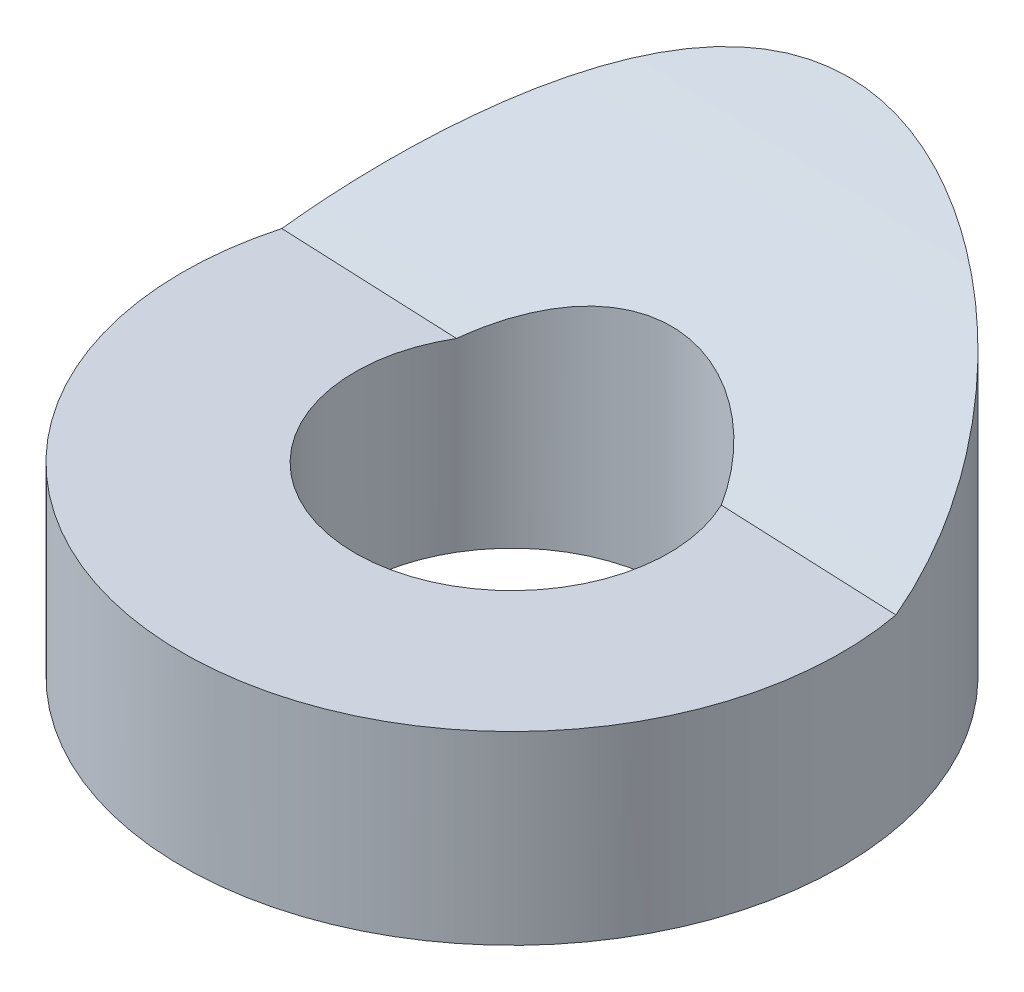
ISO-10303-21;
HEADER;
FILE_DESCRIPTION(('STEP AP214'),'2;1');
FILE_NAME('part.step','',(''),(''),'','','');
FILE_SCHEMA(('AUTOMOTIVE_DESIGN { 1 0 10303 214 1 1 1 1 }'));
ENDSEC;
DATA;
#1=APPLICATION_CONTEXT('core data for automotive mechanical design processes');
#2=APPLICATION_PROTOCOL_DEFINITION('international standard','automotive_design',2000,#1);
#3=PRODUCT_CONTEXT('',#1,'mechanical');
#4=PRODUCT('Part','Part','',(#3));
#5=PRODUCT_RELATED_PRODUCT_CATEGORY('part','',(#4));
#6=PRODUCT_DEFINITION_FORMATION('','',#4);
#7=PRODUCT_DEFINITION_CONTEXT('part definition',#1,'design');
#8=PRODUCT_DEFINITION('design','',#6,#7);
#9=PRODUCT_DEFINITION_SHAPE('','',#8);
#10=(LENGTH_UNIT() NAMED_UNIT(*) SI_UNIT(.MILLI.,.METRE.));
#11=(NAMED_UNIT(*) PLANE_ANGLE_UNIT() SI_UNIT($,.RADIAN.));
#12=(NAMED_UNIT(*) SI_UNIT($,.STERADIAN.) SOLID_ANGLE_UNIT());
#13=UNCERTAINTY_MEASURE_WITH_UNIT(LENGTH_MEASURE(1.E-05),#10,'distance_accuracy_value','');
#14=(GEOMETRIC_REPRESENTATION_CONTEXT(3) GLOBAL_UNCERTAINTY_ASSIGNED_CONTEXT((#13)) GLOBAL_UNIT_ASSIGNED_CONTEXT((#10,
#11,#12)) REPRESENTATION_CONTEXT('',''));
#15=CARTESIAN_POINT('',(0.,0.,0.));
#16=DIRECTION('',(0.,0.,1.));
#17=DIRECTION('',(1.,0.,0.));
#18=AXIS2_PLACEMENT_3D('',#15,#16,#17);
#19=CARTESIAN_POINT('',(0.,1.,0.));
#20=DIRECTION('',(0.,1.,0.));
#21=DIRECTION('',(0.,0.,1.));
#22=AXIS2_PLACEMENT_3D('',#19,#20,#21);
#23=PLANE('',#22);
#24=DIRECTION('',(0.999076110791197,0.,0.0429758635321846));
#25=VECTOR('',#24,1.);
#26=CARTESIAN_POINT('',(-983.690651961751,1.,-43.4907246175211));
#27=LINE('',#26,#25);
#28=CARTESIAN_POINT('',(-5.06143830664731,0.99999999999998,-1.39439673981376));
#29=VERTEX_POINT('',#28);
#30=CARTESIAN_POINT('',(-2.15379205053056,0.999999999999992,-1.26932257644118));
#31=VERTEX_POINT('',#30);
#32=EDGE_CURVE('E54',#29,#31,#27,.T.);
#33=ORIENTED_EDGE('',*,*,#32,.F.);
#34=CARTESIAN_POINT('',(0.,1.,0.));
#35=DIRECTION('',(0.,1.,0.));
#36=DIRECTION('',(0.,0.,1.));
#37=AXIS2_PLACEMENT_3D('',#34,#35,#36);
#38=CIRCLE('',#37,5.25);
#39=CARTESIAN_POINT('',(5.16248219344577,1.00000000000332,-0.954608612131368));
#40=VERTEX_POINT('',#39);
#41=EDGE_CURVE('E11',#29,#40,#38,.T.);
#42=ORIENTED_EDGE('',*,*,#41,.T.);
#43=CARTESIAN_POINT('',(2.25483593732881,1.00000000000001,-1.07968277550512));
#44=VERTEX_POINT('',#43);
#45=EDGE_CURVE('E63',#44,#40,#27,.T.);
#46=ORIENTED_EDGE('',*,*,#45,.F.);
#47=CARTESIAN_POINT('',(0.,1.,0.));
#48=DIRECTION('',(0.,1.,0.));
#49=DIRECTION('',(0.,0.,1.));
#50=AXIS2_PLACEMENT_3D('',#47,#48,#49);
#51=CIRCLE('',#50,2.49999999999838);
#52=EDGE_CURVE('E48',#31,#44,#51,.T.);
#53=ORIENTED_EDGE('',*,*,#52,.F.);
#54=EDGE_LOOP('',(#33,#42,#46,#53));
#55=FACE_BOUND('',#54,.T.);
#56=ADVANCED_FACE('F39',(#55),#23,.T.);
#57=CARTESIAN_POINT('',(0.,1.,0.));
#58=DIRECTION('',(0.,-1.,0.));
#59=DIRECTION('',(0.,0.,-1.));
#60=AXIS2_PLACEMENT_3D('',#57,#58,#59);
#61=CYLINDRICAL_SURFACE('',#60,5.25);
#62=ORIENTED_EDGE('',*,*,#41,.F.);
#63=CARTESIAN_POINT('',(0.,3.74877773049863,-5.25));
#64=CARTESIAN_POINT('',(-0.126007067247503,3.7433254065822,-5.24999867491502));
#65=CARTESIAN_POINT('',(-0.251837637186337,3.73331497708894,-5.24545240428106));
#66=CARTESIAN_POINT('',(-0.501914747179272,3.7045960008069,-5.2274582401621));
#67=CARTESIAN_POINT('',(-0.626160165809427,3.68588161274603,-5.21400436616579));
#68=CARTESIAN_POINT('',(-0.872232776773965,3.64044545702325,-5.17853231483911));
#69=CARTESIAN_POINT('',(-0.994053525630694,3.61370477905814,-5.15649387496125));
#70=CARTESIAN_POINT('',(-1.23419068622258,3.5531702907075,-5.10435052280447));
#71=CARTESIAN_POINT('',(-1.35250515133748,3.51937264320143,-5.07424121957766));
#72=CARTESIAN_POINT('',(-1.69838937778298,3.40983229058983,-4.97344146722765));
#73=CARTESIAN_POINT('',(-1.92007618972252,3.32530906053183,-4.8917972340984));
#74=CARTESIAN_POINT('',(-2.34483831630134,3.14034492768009,-4.70301929931433));
#75=CARTESIAN_POINT('',(-2.54790998451284,3.03990091671551,-4.59588061839608));
#76=CARTESIAN_POINT('',(-2.88168156266055,2.8582087889182,-4.39152296017341));
#77=CARTESIAN_POINT('',(-3.01695948586396,2.77924749389846,-4.29963709779462));
#78=CARTESIAN_POINT('',(-3.27724075694383,2.61808409492658,-4.10470959362967));
#79=CARTESIAN_POINT('',(-3.40224061297586,2.53588090350007,-4.00166418785269));
#80=CARTESIAN_POINT('',(-3.64181029570238,2.36981958365057,-3.78494912192042));
#81=CARTESIAN_POINT('',(-3.75636662525251,2.28595947939885,-3.67126608754338));
#82=CARTESIAN_POINT('',(-3.97450552261269,2.11813357532121,-3.43391623484501));
#83=CARTESIAN_POINT('',(-4.07808918977483,2.03416778693836,-3.31025041889124));
#84=CARTESIAN_POINT('',(-4.27446059390753,1.86684525185515,-3.05252517867555));
#85=CARTESIAN_POINT('',(-4.36716948416952,1.78349662189894,-2.91840033656343));
#86=CARTESIAN_POINT('',(-4.54027931267237,1.61922169889037,-2.64103811828993));
#87=CARTESIAN_POINT('',(-4.62068130930034,1.53829519801813,-2.49780152723614));
#88=CARTESIAN_POINT('',(-4.7683167924383,1.38005019071997,-2.20291274390428));
#89=CARTESIAN_POINT('',(-4.83555806082638,1.30272957288203,-2.05126559325113));
#90=CARTESIAN_POINT('',(-4.95598085629029,1.15273307520768,-1.74027309649509));
#91=CARTESIAN_POINT('',(-5.00916335056153,1.08005687611217,-1.58092828085764));
#92=CARTESIAN_POINT('',(-5.09886171227341,0.942794482516335,-1.26123008189652));
#93=CARTESIAN_POINT('',(-5.1358936270369,0.878014663356158,-1.10110519438192));
#94=CARTESIAN_POINT('',(-5.19499358169551,0.754545175353423,-0.775799033511059));
#95=CARTESIAN_POINT('',(-5.21706163903406,0.695855499411626,-0.610617766049262));
#96=CARTESIAN_POINT('',(-5.24537006832547,0.585319590986969,-0.276807046313556));
#97=CARTESIAN_POINT('',(-5.25162553893536,0.533466875116054,-0.108181038502914));
#98=CARTESIAN_POINT('',(-5.24765670305613,0.437067273894638,0.230950778993963));
#99=CARTESIAN_POINT('',(-5.23743544378514,0.392519039326772,0.401456235301984));
#100=CARTESIAN_POINT('',(-5.20278404995358,0.316932360940514,0.717665053313427));
#101=CARTESIAN_POINT('',(-5.18063063489321,0.284871571794528,0.863377643752019));
#102=CARTESIAN_POINT('',(-5.12384753247191,0.226324788868689,1.15348370495509));
#103=CARTESIAN_POINT('',(-5.08921899247452,0.199838282765057,1.2978772957789));
#104=CARTESIAN_POINT('',(-5.00755767643835,0.152328817763976,1.58397990201976));
#105=CARTESIAN_POINT('',(-4.96052878748205,0.131304150860835,1.72568974380586));
#106=CARTESIAN_POINT('',(-4.85429342403477,0.0944406894220785,2.00516336995943));
#107=CARTESIAN_POINT('',(-4.79508726513568,0.0786017605179886,2.14292725648676));
#108=CARTESIAN_POINT('',(-4.66978576617275,0.0527176878237961,2.40309347874187));
#109=CARTESIAN_POINT('',(-4.60454139303828,0.0423268347495606,2.52587258996542));
#110=CARTESIAN_POINT('',(-4.4643671159375,0.0252278127455858,2.76609287259869));
#111=CARTESIAN_POINT('',(-4.38943413088637,0.0185208188995944,2.88353232981236));
#112=CARTESIAN_POINT('',(-4.23042616826797,0.008326160566413,3.11213347344679));
#113=CARTESIAN_POINT('',(-4.14635429079162,0.00483740817469597,3.22329726937355));
#114=CARTESIAN_POINT('',(-3.96957873634187,0.000558003837893365,3.43865673095254));
#115=CARTESIAN_POINT('',(-3.87687180116177,-0.000231625394516991,3.54284974067803));
#116=CARTESIAN_POINT('',(-3.68171099199026,0.000351966313673459,3.74534842885033));
#117=CARTESIAN_POINT('',(-3.57911072610411,0.00176471159114148,3.84351289127491));
#118=CARTESIAN_POINT('',(-3.36628151506501,0.00624558618698144,4.03122688980137));
#119=CARTESIAN_POINT('',(-3.25604978928342,0.00931432168513758,4.12077325707309));
#120=CARTESIAN_POINT('',(-3.02874283939125,0.01653407658346,4.29061079166826));
#121=CARTESIAN_POINT('',(-2.9116690087159,0.0206848762066182,4.37090383365554));
#122=CARTESIAN_POINT('',(-2.67137672309177,0.0295255174885543,4.52176732634699));
#123=CARTESIAN_POINT('',(-2.5481559899519,0.0342155598567759,4.59233413526011));
#124=CARTESIAN_POINT('',(-2.2920528664446,0.0437933657946398,4.72551981053636));
#125=CARTESIAN_POINT('',(-2.15898376032963,0.0486823627343023,4.78777990241833));
#126=CARTESIAN_POINT('',(-1.88803350260672,0.0580081778816843,4.90095847143124));
#127=CARTESIAN_POINT('',(-1.75015056414939,0.0624448257337551,4.95187268417532));
#128=CARTESIAN_POINT('',(-1.47062975381472,0.0704537952815546,5.04195411774127));
#129=CARTESIAN_POINT('',(-1.32899328013886,0.0740264339378962,5.08112564761775));
#130=CARTESIAN_POINT('',(-1.04286239156897,0.0799995920755643,5.14747644040425));
#131=CARTESIAN_POINT('',(-0.89836700953823,0.0823997075993504,5.17465157000547));
#132=CARTESIAN_POINT('',(-0.607114661584651,0.0858295094935614,5.21686059935951));
#133=CARTESIAN_POINT('',(-0.460351850753659,0.0868546945754154,5.23185455718043));
#134=CARTESIAN_POINT('',(-0.166082165207098,0.0874346101979431,5.24944213853654));
#135=CARTESIAN_POINT('',(-0.0185752901222126,0.0869893400086871,5.25203575591623));
#136=CARTESIAN_POINT('',(0.276148726644874,0.0846651298074513,5.24480452702312));
#137=CARTESIAN_POINT('',(0.423365811235206,0.0827859310777984,5.23497743952494));
#138=CARTESIAN_POINT('',(0.716378329626791,0.0777523114121107,5.20298133103351));
#139=CARTESIAN_POINT('',(0.862174238367812,0.0745983325787495,5.18081658782156));
#140=CARTESIAN_POINT('',(1.15074453125176,0.0673028696711175,5.12443248326694));
#141=CARTESIAN_POINT('',(1.29352913911591,0.0631656483934522,5.09026486219515));
#142=CARTESIAN_POINT('',(1.57566686205067,0.0542690984421768,5.01011702710072));
#143=CARTESIAN_POINT('',(1.71502120792993,0.0495099968885012,4.96414111974991));
#144=CARTESIAN_POINT('',(1.98945456531644,0.0398249368568939,4.86066723718461));
#145=CARTESIAN_POINT('',(2.12453150100318,0.0348988996950929,4.80316376396198));
#146=CARTESIAN_POINT('',(2.38935903322878,0.025416192911795,4.6770678918466));
#147=CARTESIAN_POINT('',(2.51911157082973,0.0208593880817914,4.60847957989408));
#148=CARTESIAN_POINT('',(2.7733666599666,0.0126708481110203,4.46012975708004));
#149=CARTESIAN_POINT('',(2.8978241390658,0.00904608562866188,4.38029057480595));
#150=CARTESIAN_POINT('',(3.13954204699722,0.00340508006173905,4.21041425884952));
#151=CARTESIAN_POINT('',(3.25680525669333,0.00138821180159714,4.12038110431572));
#152=CARTESIAN_POINT('',(3.4833695632476,-0.000383713716026649,3.93070847400713));
#153=CARTESIAN_POINT('',(3.59266825891464,-0.000138091684210321,3.83106612205626));
#154=CARTESIAN_POINT('',(3.80240830049537,0.00326810169419291,3.62298262244395));
#155=CARTESIAN_POINT('',(3.90285334092745,0.00642745080999685,3.5145451814816));
#156=CARTESIAN_POINT('',(4.09273913701988,0.0162077693476966,3.29137179193164));
#157=CARTESIAN_POINT('',(4.18232254022707,0.0227760219590678,3.17675493873383));
#158=CARTESIAN_POINT('',(4.35151675772657,0.0398826379893438,2.94072712835843));
#159=CARTESIAN_POINT('',(4.43113157531959,0.0504194008299425,2.819318927052));
#160=CARTESIAN_POINT('',(4.57985177900736,0.0759287807901946,2.57068840024817));
#161=CARTESIAN_POINT('',(4.64895836961815,0.0909008889230417,2.44346674330139));
#162=CARTESIAN_POINT('',(4.77621396476889,0.125650227419201,2.18428935087851));
#163=CARTESIAN_POINT('',(4.83436330284565,0.145427311477938,2.05233375964813));
#164=CARTESIAN_POINT('',(4.93737845748367,0.18918712211347,1.78994327279956));
#165=CARTESIAN_POINT('',(4.98266618505099,0.212980763740764,1.65964219797415));
#166=CARTESIAN_POINT('',(5.06266105680508,0.265368479070202,1.39672829758587));
#167=CARTESIAN_POINT('',(5.09736462385808,0.293964170671576,1.26411470643374));
#168=CARTESIAN_POINT('',(5.15612951461669,0.355940746260594,0.997711540459324));
#169=CARTESIAN_POINT('',(5.18019471763741,0.389319880060792,0.863922412480937));
#170=CARTESIAN_POINT('',(5.2178056541254,0.460777688088927,0.596073571776651));
#171=CARTESIAN_POINT('',(5.23134738633944,0.498858143490743,0.462013775541609));
#172=CARTESIAN_POINT('',(5.24816777006466,0.579827853554657,0.193549435731917));
#173=CARTESIAN_POINT('',(5.25136482322614,0.622752590530634,0.0591504804193493));
#174=CARTESIAN_POINT('',(5.24757892162068,0.712871418261765,-0.20808086275158));
#175=CARTESIAN_POINT('',(5.24059229345758,0.760067043825744,-0.340912667891392));
#176=CARTESIAN_POINT('',(5.20488516010958,0.907522570212846,-0.735819238101158));
#177=CARTESIAN_POINT('',(5.1614280134265,1.01370744991923,-0.994491143815246));
#178=CARTESIAN_POINT('',(5.03277577504271,1.24890195694601,-1.52122725917281));
#179=CARTESIAN_POINT('',(4.94401345200972,1.37912116487743,-1.78785595058195));
#180=CARTESIAN_POINT('',(4.72760621377075,1.64915785050649,-2.29990298151003));
#181=CARTESIAN_POINT('',(4.59992806655152,1.78898345218762,-2.54530296201701));
#182=CARTESIAN_POINT('',(4.37159765914707,2.01144721120874,-2.91139826525086));
#183=CARTESIAN_POINT('',(4.28284350295877,2.09288955437125,-3.04043426613455));
#184=CARTESIAN_POINT('',(4.09419935534497,2.25579810851662,-3.29005962899968));
#185=CARTESIAN_POINT('',(3.99431216374193,2.33726430838273,-3.41065110231052));
#186=CARTESIAN_POINT('',(3.78366426049317,2.49895840605939,-3.64293541441766));
#187=CARTESIAN_POINT('',(3.67289998412508,2.57918588787218,-3.75462531405023));
#188=CARTESIAN_POINT('',(3.4407628094927,2.73685352475554,-3.96844413144485));
#189=CARTESIAN_POINT('',(3.31939239769888,2.81429432714864,-4.07057527856628));
#190=CARTESIAN_POINT('',(2.99068881147649,3.0095158809684,-4.32239224749658));
#191=CARTESIAN_POINT('',(2.77515464068282,3.12390181335334,-4.46424309575913));
#192=CARTESIAN_POINT('',(2.31822249919447,3.33250936452301,-4.7176690023668));
#193=CARTESIAN_POINT('',(2.07686832233667,3.42676433884028,-4.8292942258838));
#194=CARTESIAN_POINT('',(1.62457223295687,3.567716727559,-4.99682867586039));
#195=CARTESIAN_POINT('',(1.41804391883879,3.62026157821139,-5.05953438782765));
#196=CARTESIAN_POINT('',(1.10058540467766,3.68071273472859,-5.13449703131694));
#197=CARTESIAN_POINT('',(0.993562920929742,3.69779675950941,-5.15629365383107));
#198=CARTESIAN_POINT('',(0.777559560265363,3.72538800009376,-5.19325344627154));
#199=CARTESIAN_POINT('',(0.668579579290691,3.73589814962117,-5.20841957427831));
#200=CARTESIAN_POINT('',(0.466341502125555,3.74891316254162,-5.23007839987339));
#201=CARTESIAN_POINT('',(0.373248882788168,3.75240213599625,-5.23754759137102));
#202=CARTESIAN_POINT('',(0.186738592662124,3.75435364677268,-5.24750910983955));
#203=CARTESIAN_POINT('',(0.0933208929102667,3.75281572414004,-5.25000098135856));
#204=CARTESIAN_POINT('',(0.,3.74877773049863,-5.25));
#205=B_SPLINE_CURVE_WITH_KNOTS('',3,(#63,#64,#65,#66,#67,#68,#69,#70,#71,#72,#73,#74,#75,#76,
#77,#78,#79,#80,#81,#82,#83,#84,#85,#86,#87,#88,#89,#90,#91,#92,#93,#94,#95,#96,#97,#98,#99,
#100,#101,#102,#103,#104,#105,#106,#107,#108,#109,#110,#111,#112,#113,#114,#115,#116,#117,#118,
#119,#120,#121,#122,#123,#124,#125,#126,#127,#128,#129,#130,#131,#132,#133,#134,#135,#136,#137,
#138,#139,#140,#141,#142,#143,#144,#145,#146,#147,#148,#149,#150,#151,#152,#153,#154,#155,#156,
#157,#158,#159,#160,#161,#162,#163,#164,#165,#166,#167,#168,#169,#170,#171,#172,#173,#174,#175,
#176,#177,#178,#179,#180,#181,#182,#183,#184,#185,#186,#187,#188,#189,#190,#191,#192,#193,#194,
#195,#196,#197,#198,#199,#200,#201,#202,#203,#204),.UNSPECIFIED.,.T.,.F.,(4,2,2,2,2,2,2,2,2,2,2,
2,2,2,2,2,2,2,2,2,2,2,2,2,2,2,2,2,2,2,2,2,2,2,2,2,2,2,2,2,2,2,2,2,2,2,2,2,2,2,2,2,2,2,2,2,2,2,2,
2,2,2,2,2,2,2,2,2,2,2,4),(0.,0.378254491767251,0.756763199203565,1.13617078535126,
1.51578520837577,2.26531784969605,3.01499700088188,3.55914779178426,4.10348269375372,
4.64851140263724,5.19348545329184,5.74219410119483,6.2908555338656,6.83919155890133,
7.38748985047751,7.91668812357052,8.44588577977384,8.97457794010723,9.50317233495402,
9.95507343223064,10.4069329778171,10.8586510490354,11.3103574147892,11.7281501901484,
12.1460761564836,12.563860793975,12.9818037148364,13.407333917803,13.8330199930401,
14.258619674859,14.6843782834476,15.1248447699385,15.5654765290596,16.0059463969745,
16.4465679086893,16.888628447509,17.3306892057663,17.7728297420448,18.2148170722778,
18.6549220649599,19.094866771648,19.535021808873,19.9750149311958,20.4182097156701,
20.8612320946035,21.3043874907564,21.7473570795512,22.1836719544609,22.6198110431071,
23.0559001011265,23.4919758825277,23.9114263871237,24.3310184969137,24.7504574745667,
25.1700558541485,25.5929560392755,26.0160088081643,26.861536819332,27.7872467653672,
28.7137494430669,29.2428476466641,29.7718130874892,30.3009524672118,30.8299681281896,
31.673555125724,32.5157333270124,33.179210876672,33.5105034578388,33.8416480873523,
34.1217579103833,34.4018933638155),.UNSPECIFIED.);
#206=EDGE_CURVE('E70',#40,#29,#205,.T.);
#207=ORIENTED_EDGE('',*,*,#206,.F.);
#208=EDGE_LOOP('',(#62,#207));
#209=FACE_BOUND('',#208,.T.);
#210=CARTESIAN_POINT('',(0.,-1.9497474684763,0.));
#211=DIRECTION('',(0.,1.,0.));
#212=DIRECTION('',(-1.,0.,0.));
#213=AXIS2_PLACEMENT_3D('',#210,#211,#212);
#214=CIRCLE('',#213,5.25);
#215=CARTESIAN_POINT('',(-5.25,-1.94974746847645,0.));
#216=VERTEX_POINT('',#215);
#217=EDGE_CURVE('E80',#216,#216,#214,.F.);
#218=ORIENTED_EDGE('',*,*,#217,.F.);
#219=EDGE_LOOP('',(#218));
#220=FACE_BOUND('',#219,.T.);
#221=ADVANCED_FACE('F41',(#209,#220),#61,.T.);
#222=CARTESIAN_POINT('',(0.,1.,0.));
#223=DIRECTION('',(0.,-1.,0.));
#224=DIRECTION('',(0.,0.,-1.));
#225=AXIS2_PLACEMENT_3D('',#222,#223,#224);
#226=CYLINDRICAL_SURFACE('',#225,2.49999999999838);
#227=ORIENTED_EDGE('',*,*,#52,.T.);
#228=CARTESIAN_POINT('',(0.,1.65098880107359,-2.49999999999838));
#229=CARTESIAN_POINT('',(-0.13013143101563,1.64781200284794,-2.4999908073007));
#230=CARTESIAN_POINT('',(-0.260208622739158,1.63885237140291,-2.48978122115488));
#231=CARTESIAN_POINT('',(-0.516104795251461,1.61015003133415,-2.44958489071568));
#232=CARTESIAN_POINT('',(-0.641918427261565,1.59039427442725,-2.4195742055366));
#233=CARTESIAN_POINT('',(-0.885285537556417,1.54184496212682,-2.34148117371784));
#234=CARTESIAN_POINT('',(-1.00287197423165,1.51309033461232,-2.29347649302308));
#235=CARTESIAN_POINT('',(-1.22788918708378,1.44851526471915,-2.18130893695397));
#236=CARTESIAN_POINT('',(-1.33531903793128,1.41269417945725,-2.11714459127904));
#237=CARTESIAN_POINT('',(-1.54560752903795,1.33324944967429,-1.96946062617277));
#238=CARTESIAN_POINT('',(-1.64757497229957,1.28924904071269,-1.88487746161899));
#239=CARTESIAN_POINT('',(-1.8362004238451,1.1978034456463,-1.7016680913723));
#240=CARTESIAN_POINT('',(-1.92285155529518,1.15035672561177,-1.60303561342126));
#241=CARTESIAN_POINT('',(-2.08798344409813,1.04887584264876,-1.38249649478744));
#242=CARTESIAN_POINT('',(-2.16455362233272,0.994686049573101,-1.25922545748678));
#243=CARTESIAN_POINT('',(-2.29542025482112,0.887142984121921,-1.00100307531866));
#244=CARTESIAN_POINT('',(-2.34970987878474,0.833789973082658,-0.866048163992629));
#245=CARTESIAN_POINT('',(-2.4357070524306,0.728337551009535,-0.583023079637367));
#246=CARTESIAN_POINT('',(-2.4666002565345,0.676339444335772,-0.434665479027111));
#247=CARTESIAN_POINT('',(-2.5010576538902,0.577516410216253,-0.133115199048308));
#248=CARTESIAN_POINT('',(-2.50462924618893,0.530690085570629,0.0200761599905451));
#249=CARTESIAN_POINT('',(-2.48379658937812,0.44546898508463,0.319995611591146));
#250=CARTESIAN_POINT('',(-2.46055373342182,0.406803874189393,0.466726608605156));
#251=CARTESIAN_POINT('',(-2.38782717326037,0.336280066462216,0.755240085737808));
#252=CARTESIAN_POINT('',(-2.33835292785077,0.304418921988693,0.897024329980478));
#253=CARTESIAN_POINT('',(-2.21770851236584,0.249257752109914,1.16267885447185));
#254=CARTESIAN_POINT('',(-2.1479478144717,0.225571092689426,1.28711031795425));
#255=CARTESIAN_POINT('',(-1.98771666508229,0.183993932989695,1.5229215886764));
#256=CARTESIAN_POINT('',(-1.89724965403538,0.166102471003376,1.63430355950587));
#257=CARTESIAN_POINT('',(-1.70109105572646,0.135880320659247,1.83728987939934));
#258=CARTESIAN_POINT('',(-1.59591937068474,0.123402907405314,1.92937560571445));
#259=CARTESIAN_POINT('',(-1.37144612104841,0.102493684808953,2.09489352526981));
#260=CARTESIAN_POINT('',(-1.25214499627226,0.0940617495809177,2.1683262989119));
#261=CARTESIAN_POINT('',(-1.00328818760337,0.0805156264176022,2.29407455796956));
#262=CARTESIAN_POINT('',(-0.87377276686717,0.0753890773036181,2.34646844196878));
#263=CARTESIAN_POINT('',(-0.607758995455789,0.0678147316607767,2.42899631417926));
#264=CARTESIAN_POINT('',(-0.471260542470732,0.0653669743912329,2.45912997615141));
#265=CARTESIAN_POINT('',(-0.194727928177157,0.0628182400809097,2.49631748311383));
#266=CARTESIAN_POINT('',(-0.0546846260751514,0.0627241195871224,2.50330384478094));
#267=CARTESIAN_POINT('',(0.224587384016098,0.0648865735197709,2.49380862671842));
#268=CARTESIAN_POINT('',(0.363816083282102,0.0671431730729184,2.47732679613794));
#269=CARTESIAN_POINT('',(0.637636521516328,0.0743175841157308,2.42135595494679));
#270=CARTESIAN_POINT('',(0.772223805166051,0.0792378808042396,2.38184545621131));
#271=CARTESIAN_POINT('',(1.03278005423246,0.0923191860305336,2.28098212666064));
#272=CARTESIAN_POINT('',(1.15874920297016,0.10048012560971,2.21962976062796));
#273=CARTESIAN_POINT('',(1.39822195615691,0.120768880223783,2.07710138946064));
#274=CARTESIAN_POINT('',(1.51175041891956,0.132888584654941,1.99596600066187));
#275=CARTESIAN_POINT('',(1.72341963386765,0.161869351374612,1.81633969664532));
#276=CARTESIAN_POINT('',(1.82156125788081,0.178730144878779,1.71784976541864));
#277=CARTESIAN_POINT('',(1.99959218968154,0.217790975142802,1.50686517045635));
#278=CARTESIAN_POINT('',(2.07952047776094,0.239979396470982,1.39440122712419));
#279=CARTESIAN_POINT('',(2.21941959053773,0.290072938048857,1.15885439847957));
#280=CARTESIAN_POINT('',(2.27939027284651,0.317978099082642,1.03577143741304));
#281=CARTESIAN_POINT('',(2.37869960889264,0.3798105496495,0.781424405002295));
#282=CARTESIAN_POINT('',(2.41781495957101,0.41379800864308,0.65008798783941));
#283=CARTESIAN_POINT('',(2.47402818470675,0.487143895842066,0.384257533262687));
#284=CARTESIAN_POINT('',(2.49112219935492,0.526503264276971,0.249762946503199));
#285=CARTESIAN_POINT('',(2.50377896185343,0.611336764288057,-0.0239556621420577));
#286=CARTESIAN_POINT('',(2.49849252560157,0.656987282328624,-0.163163663933023));
#287=CARTESIAN_POINT('',(2.46528311809248,0.751824839813279,-0.437611976258347));
#288=CARTESIAN_POINT('',(2.43735356278123,0.801012904095998,-0.572851120894625));
#289=CARTESIAN_POINT('',(2.35771674814001,0.904186590318769,-0.843963701810083));
#290=CARTESIAN_POINT('',(2.30472095623644,0.958284851078359,-0.97941650033435));
#291=CARTESIAN_POINT('',(2.17607644909022,1.0662867189103,-1.23924404721058));
#292=CARTESIAN_POINT('',(2.10041880150477,1.12019024073032,-1.36361440220644));
#293=CARTESIAN_POINT('',(1.925159581834,1.22682287720483,-1.60197830950726));
#294=CARTESIAN_POINT('',(1.82486181870685,1.27945739690652,-1.71550525870941));
#295=CARTESIAN_POINT('',(1.60367887633801,1.37827137670195,-1.92387775314198));
#296=CARTESIAN_POINT('',(1.48279417638004,1.42445098702665,-2.01872373317251));
#297=CARTESIAN_POINT('',(1.2298693828446,1.50442660364422,-2.1814584135891));
#298=CARTESIAN_POINT('',(1.09875420281017,1.53874737796513,-2.25050526458841));
#299=CARTESIAN_POINT('',(0.893058563558697,1.58090841055636,-2.33623250007912));
#300=CARTESIAN_POINT('',(0.823024928717961,1.59340500831081,-2.36182648100137));
#301=CARTESIAN_POINT('',(0.680484243398507,1.61499341971952,-2.40676452444009));
#302=CARTESIAN_POINT('',(0.607978304954766,1.6240867426776,-2.42611135695411));
#303=CARTESIAN_POINT('',(0.44714688910863,1.63998260980754,-2.4613127065251));
#304=CARTESIAN_POINT('',(0.358440263473595,1.64601816944348,-2.47579871824531));
#305=CARTESIAN_POINT('',(0.179813726531541,1.65261828160277,-2.4951451197117));
#306=CARTESIAN_POINT('',(0.0898939218955231,1.65318331203337,-2.50000635025244));
#307=CARTESIAN_POINT('',(0.,1.65098880107359,-2.49999999999838));
#308=B_SPLINE_CURVE_WITH_KNOTS('',3,(#228,#229,#230,#231,#232,#233,#234,#235,#236,#237,#238,
#239,#240,#241,#242,#243,#244,#245,#246,#247,#248,#249,#250,#251,#252,#253,#254,#255,#256,#257,
#258,#259,#260,#261,#262,#263,#264,#265,#266,#267,#268,#269,#270,#271,#272,#273,#274,#275,#276,
#277,#278,#279,#280,#281,#282,#283,#284,#285,#286,#287,#288,#289,#290,#291,#292,#293,#294,#295,
#296,#297,#298,#299,#300,#301,#302,#303,#304,#305,#306,#307),.UNSPECIFIED.,.T.,.F.,(4,2,2,2,2,2,
2,2,2,2,2,2,2,2,2,2,2,2,2,2,2,2,2,2,2,2,2,2,2,2,2,2,2,2,2,2,2,2,2,4),(0.,0.390160259708781,
0.780793116471349,1.16975897760472,1.55876024191484,1.97586948981796,2.39316554150057,
2.85580029524245,3.31857676778736,3.79680186884006,4.27489745574487,4.73303899009675,
5.19101543510526,5.62268529094635,6.05428347487247,6.47331670303052,6.89233689103019,
7.30978083484089,7.72723089646295,8.14589692037669,8.56456741943343,8.98362920813654,
9.40268207997637,9.82088173756178,10.2390576911281,10.6563300755263,11.0736054369129,
11.4952632377829,11.9169949350471,12.3548690140647,12.7928704616236,13.2563481092368,
13.7200086810252,14.1986877222792,14.6773556209474,15.1307718400597,15.3572649746087,
15.5836575433225,15.8532011879797,16.1227212850021),.UNSPECIFIED.);
#309=EDGE_CURVE('E72',#44,#31,#308,.T.);
#310=ORIENTED_EDGE('',*,*,#309,.T.);
#311=EDGE_LOOP('',(#227,#310));
#312=FACE_BOUND('',#311,.T.);
#313=CARTESIAN_POINT('',(0.,-1.9497474684763,0.));
#314=DIRECTION('',(0.,1.,0.));
#315=DIRECTION('',(-1.,0.,0.));
#316=AXIS2_PLACEMENT_3D('',#313,#314,#315);
#317=CIRCLE('',#316,2.49999999999838);
#318=CARTESIAN_POINT('',(-2.49999999999838,-1.94974746847637,0.));
#319=VERTEX_POINT('',#318);
#320=EDGE_CURVE('E164',#319,#319,#317,.F.);
#321=ORIENTED_EDGE('',*,*,#320,.T.);
#322=EDGE_LOOP('',(#321));
#323=FACE_BOUND('',#322,.T.);
#324=ADVANCED_FACE('F97',(#312,#323),#226,.F.);
#325=CARTESIAN_POINT('',(-5.21025987161655,-1.94974746847645,4.78050123629713));
#326=DIRECTION('',(0.,1.,0.));
#327=DIRECTION('',(-0.999076110791196,0.,-0.042975863532193));
#328=AXIS2_PLACEMENT_3D('',#325,#326,#327);
#329=PLANE('',#328);
#330=ORIENTED_EDGE('',*,*,#217,.T.);
#331=EDGE_LOOP('',(#330));
#332=FACE_BOUND('',#331,.T.);
#333=ORIENTED_EDGE('',*,*,#320,.F.);
#334=EDGE_LOOP('',(#333));
#335=FACE_BOUND('',#334,.T.);
#336=ADVANCED_FACE('F96',(#332,#335),#329,.F.);
#337=CARTESIAN_POINT('',(-983.902937067803,12.6999999999807,-38.5556526794232));
#338=DIRECTION('',(0.999076110791197,0.,0.0429758635321846));
#339=DIRECTION('',(0.0358594011634156,0.551147360345698,-0.833637025648556));
#340=AXIS2_PLACEMENT_3D('',#337,#338,#339);
#341=CYLINDRICAL_SURFACE('',#340,12.7);
#342=ORIENTED_EDGE('',*,*,#206,.T.);
#343=ORIENTED_EDGE('',*,*,#32,.T.);
#344=ORIENTED_EDGE('',*,*,#309,.F.);
#345=ORIENTED_EDGE('',*,*,#45,.T.);
#346=EDGE_LOOP('',(#342,#343,#344,#345));
#347=FACE_BOUND('',#346,.T.);
#348=ADVANCED_FACE('F69',(#347),#341,.F.);
#349=CLOSED_SHELL('',(#56,#221,#324,#336,#348));
#350=MANIFOLD_SOLID_BREP('B2',#349);
#351=ADVANCED_BREP_SHAPE_REPRESENTATION('',(#18,#350),#14);
#352=SHAPE_DEFINITION_REPRESENTATION(#9,#351);
ENDSEC;
END-ISO-10303-21;
